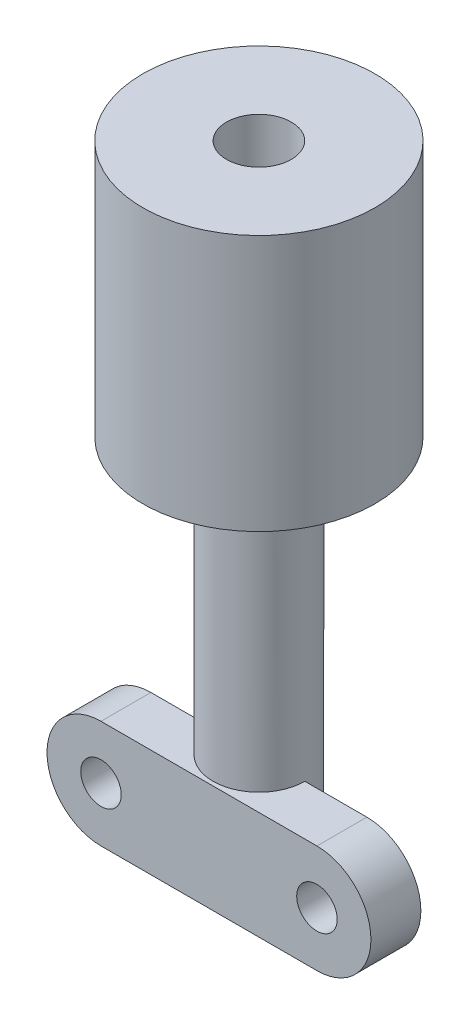
ISO-10303-21;
HEADER;
FILE_DESCRIPTION(('STEP AP214'),'2;1');
FILE_NAME('part.step','',(''),(''),'','','');
FILE_SCHEMA(('AUTOMOTIVE_DESIGN { 1 0 10303 214 1 1 1 1 }'));
ENDSEC;
DATA;
#1=APPLICATION_CONTEXT('core data for automotive mechanical design processes');
#2=APPLICATION_PROTOCOL_DEFINITION('international standard','automotive_design',2000,#1);
#3=PRODUCT_CONTEXT('',#1,'mechanical');
#4=PRODUCT('Part','Part','',(#3));
#5=PRODUCT_RELATED_PRODUCT_CATEGORY('part','',(#4));
#6=PRODUCT_DEFINITION_FORMATION('','',#4);
#7=PRODUCT_DEFINITION_CONTEXT('part definition',#1,'design');
#8=PRODUCT_DEFINITION('design','',#6,#7);
#9=PRODUCT_DEFINITION_SHAPE('','',#8);
#10=(LENGTH_UNIT() NAMED_UNIT(*) SI_UNIT(.MILLI.,.METRE.));
#11=(NAMED_UNIT(*) PLANE_ANGLE_UNIT() SI_UNIT($,.RADIAN.));
#12=(NAMED_UNIT(*) SI_UNIT($,.STERADIAN.) SOLID_ANGLE_UNIT());
#13=UNCERTAINTY_MEASURE_WITH_UNIT(LENGTH_MEASURE(1.E-05),#10,'distance_accuracy_value','');
#14=(GEOMETRIC_REPRESENTATION_CONTEXT(3) GLOBAL_UNCERTAINTY_ASSIGNED_CONTEXT((#13)) GLOBAL_UNIT_ASSIGNED_CONTEXT((#10,
#11,#12)) REPRESENTATION_CONTEXT('',''));
#15=CARTESIAN_POINT('',(0.,0.,0.));
#16=DIRECTION('',(0.,0.,1.));
#17=DIRECTION('',(1.,0.,0.));
#18=AXIS2_PLACEMENT_3D('',#15,#16,#17);
#19=CARTESIAN_POINT('',(-14.2500001788139,-36.5467350929976,6.));
#20=DIRECTION('',(0.,1.,0.));
#21=DIRECTION('',(1.,0.,0.));
#22=AXIS2_PLACEMENT_3D('',#19,#20,#21);
#23=PLANE('',#22);
#24=CARTESIAN_POINT('',(-14.2500001788139,-36.5467350929976,6.));
#25=DIRECTION('',(0.,1.,0.));
#26=DIRECTION('',(1.,0.,0.));
#27=AXIS2_PLACEMENT_3D('',#24,#25,#26);
#28=CIRCLE('',#27,4.4);
#29=CARTESIAN_POINT('',(-18.6500001788139,-36.5467350929976,6.));
#30=VERTEX_POINT('',#29);
#31=EDGE_CURVE('E150',#30,#30,#28,.T.);
#32=ORIENTED_EDGE('',*,*,#31,.T.);
#33=EDGE_LOOP('',(#32));
#34=FACE_BOUND('',#33,.T.);
#35=CARTESIAN_POINT('',(-14.2500001788139,-36.5467350929976,6.));
#36=DIRECTION('',(0.,1.,0.));
#37=DIRECTION('',(1.,0.,0.));
#38=AXIS2_PLACEMENT_3D('',#35,#36,#37);
#39=CIRCLE('',#38,8.6);
#40=CARTESIAN_POINT('',(-22.8500001788139,-36.5467350929976,6.));
#41=VERTEX_POINT('',#40);
#42=EDGE_CURVE('E10',#41,#41,#39,.T.);
#43=ORIENTED_EDGE('',*,*,#42,.F.);
#44=EDGE_LOOP('',(#43));
#45=FACE_BOUND('',#44,.T.);
#46=ADVANCED_FACE('F15',(#34,#45),#23,.F.);
#47=CARTESIAN_POINT('',(-14.2500001788139,-17.5467350929975,6.));
#48=DIRECTION('',(0.,1.,0.));
#49=DIRECTION('',(1.,0.,0.));
#50=AXIS2_PLACEMENT_3D('',#47,#48,#49);
#51=PLANE('',#50);
#52=CARTESIAN_POINT('',(-14.2500001788139,-17.5467350929975,6.));
#53=DIRECTION('',(0.,-1.,0.));
#54=DIRECTION('',(1.,0.,0.));
#55=AXIS2_PLACEMENT_3D('',#52,#53,#54);
#56=CIRCLE('',#55,2.4);
#57=CARTESIAN_POINT('',(-16.6500001788139,-17.5467350929975,6.));
#58=VERTEX_POINT('',#57);
#59=EDGE_CURVE('E108',#58,#58,#56,.T.);
#60=ORIENTED_EDGE('',*,*,#59,.T.);
#61=EDGE_LOOP('',(#60));
#62=FACE_BOUND('',#61,.T.);
#63=CARTESIAN_POINT('',(-14.2500001788139,-17.5467350929975,6.));
#64=DIRECTION('',(0.,1.,0.));
#65=DIRECTION('',(1.,0.,0.));
#66=AXIS2_PLACEMENT_3D('',#63,#64,#65);
#67=CIRCLE('',#66,8.6);
#68=CARTESIAN_POINT('',(-22.8500001788139,-17.5467350929975,6.));
#69=VERTEX_POINT('',#68);
#70=EDGE_CURVE('E153',#69,#69,#67,.T.);
#71=ORIENTED_EDGE('',*,*,#70,.T.);
#72=EDGE_LOOP('',(#71));
#73=FACE_BOUND('',#72,.T.);
#74=ADVANCED_FACE('F109',(#62,#73),#51,.T.);
#75=CARTESIAN_POINT('',(-14.2500001788139,-36.5467350929976,6.));
#76=DIRECTION('',(0.,1.,0.));
#77=DIRECTION('',(1.,0.,0.));
#78=AXIS2_PLACEMENT_3D('',#75,#76,#77);
#79=CYLINDRICAL_SURFACE('',#78,8.6);
#80=ORIENTED_EDGE('',*,*,#70,.F.);
#81=DIRECTION('',(0.,-1.,0.));
#82=VECTOR('',#81,1.);
#83=CARTESIAN_POINT('',(-22.8500001788139,-36.5467350929976,6.));
#84=LINE('',#83,#82);
#85=EDGE_CURVE('E25',#69,#41,#84,.T.);
#86=ORIENTED_EDGE('',*,*,#85,.T.);
#87=ORIENTED_EDGE('',*,*,#42,.T.);
#88=ORIENTED_EDGE('',*,*,#85,.F.);
#89=EDGE_LOOP('',(#80,#86,#87,#88));
#90=FACE_BOUND('',#89,.T.);
#91=ADVANCED_FACE('F384',(#90),#79,.T.);
#92=CARTESIAN_POINT('',(-14.2500001788139,-37.7467350929976,6.));
#93=DIRECTION('',(0.,1.,0.));
#94=DIRECTION('',(1.,0.,0.));
#95=AXIS2_PLACEMENT_3D('',#92,#93,#94);
#96=CONICAL_SURFACE('',#95,3.9,0.394791119699761);
#97=CARTESIAN_POINT('',(-14.2500001788139,-38.9467350929976,6.));
#98=DIRECTION('',(0.,-1.,0.));
#99=DIRECTION('',(1.,0.,0.));
#100=AXIS2_PLACEMENT_3D('',#97,#98,#99);
#101=CIRCLE('',#100,3.4);
#102=CARTESIAN_POINT('',(-17.6500001788139,-38.9467350929976,6.));
#103=VERTEX_POINT('',#102);
#104=EDGE_CURVE('E123',#103,#103,#101,.T.);
#105=ORIENTED_EDGE('',*,*,#104,.F.);
#106=DIRECTION('',(-0.384615384615385,0.923076923076923,0.));
#107=VECTOR('',#106,1.);
#108=CARTESIAN_POINT('',(-18.1500001788139,-37.7467350929976,6.));
#109=LINE('',#108,#107);
#110=EDGE_CURVE('E154',#103,#30,#109,.T.);
#111=ORIENTED_EDGE('',*,*,#110,.T.);
#112=ORIENTED_EDGE('',*,*,#31,.F.);
#113=ORIENTED_EDGE('',*,*,#110,.F.);
#114=EDGE_LOOP('',(#105,#111,#112,#113));
#115=FACE_BOUND('',#114,.T.);
#116=ADVANCED_FACE('F388',(#115),#96,.T.);
#117=CARTESIAN_POINT('',(-14.2500001788139,-38.9467350929976,6.));
#118=DIRECTION('',(0.,-1.,0.));
#119=DIRECTION('',(1.,0.,0.));
#120=AXIS2_PLACEMENT_3D('',#117,#118,#119);
#121=CYLINDRICAL_SURFACE('',#120,3.4);
#122=CARTESIAN_POINT('',(-14.2500001788139,-56.9467350929975,6.));
#123=DIRECTION('',(0.,1.,0.));
#124=DIRECTION('',(1.,0.,0.));
#125=AXIS2_PLACEMENT_3D('',#122,#123,#124);
#126=CIRCLE('',#125,3.4);
#127=CARTESIAN_POINT('',(-17.6500001788139,-56.9467350929975,6.));
#128=VERTEX_POINT('',#127);
#129=CARTESIAN_POINT('',(-10.8500001788139,-56.9467350929975,6.));
#130=VERTEX_POINT('',#129);
#131=EDGE_CURVE('E180',#128,#130,#126,.T.);
#132=ORIENTED_EDGE('',*,*,#131,.T.);
#133=DIRECTION('',(0.,1.,0.));
#134=VECTOR('',#133,1.);
#135=CARTESIAN_POINT('',(-10.8500001788139,-56.9467350929975,6.));
#136=LINE('',#135,#134);
#137=CARTESIAN_POINT('',(-10.8500001788139,-64.9467350929976,6.));
#138=VERTEX_POINT('',#137);
#139=EDGE_CURVE('E172',#138,#130,#136,.T.);
#140=ORIENTED_EDGE('',*,*,#139,.F.);
#141=CARTESIAN_POINT('',(-14.2500001788139,-64.9467350929976,6.));
#142=DIRECTION('',(0.,-1.,0.));
#143=DIRECTION('',(1.,0.,0.));
#144=AXIS2_PLACEMENT_3D('',#141,#142,#143);
#145=CIRCLE('',#144,3.4);
#146=CARTESIAN_POINT('',(-17.6500001788139,-64.9467350929976,6.));
#147=VERTEX_POINT('',#146);
#148=EDGE_CURVE('E188',#147,#138,#145,.T.);
#149=ORIENTED_EDGE('',*,*,#148,.F.);
#150=DIRECTION('',(0.,-1.,0.));
#151=VECTOR('',#150,1.);
#152=CARTESIAN_POINT('',(-17.6500001788139,-56.9467350929975,6.));
#153=LINE('',#152,#151);
#154=EDGE_CURVE('E125',#128,#147,#153,.T.);
#155=ORIENTED_EDGE('',*,*,#154,.F.);
#156=DIRECTION('',(0.,1.,0.));
#157=VECTOR('',#156,1.);
#158=CARTESIAN_POINT('',(-17.6500001788139,-38.9467350929976,6.));
#159=LINE('',#158,#157);
#160=EDGE_CURVE('E114',#128,#103,#159,.T.);
#161=ORIENTED_EDGE('',*,*,#160,.T.);
#162=ORIENTED_EDGE('',*,*,#104,.T.);
#163=ORIENTED_EDGE('',*,*,#160,.F.);
#164=EDGE_LOOP('',(#132,#140,#149,#155,#161,#162,#163));
#165=FACE_BOUND('',#164,.T.);
#166=ADVANCED_FACE('F403',(#165),#121,.T.);
#167=CARTESIAN_POINT('',(-14.2500001788139,-64.9467350929976,6.));
#168=DIRECTION('',(0.,1.,0.));
#169=DIRECTION('',(1.,0.,0.));
#170=AXIS2_PLACEMENT_3D('',#167,#168,#169);
#171=CYLINDRICAL_SURFACE('',#170,2.4);
#172=CARTESIAN_POINT('',(-14.2500001788139,-64.9467350929976,6.));
#173=DIRECTION('',(0.,1.,0.));
#174=DIRECTION('',(1.,0.,0.));
#175=AXIS2_PLACEMENT_3D('',#172,#173,#174);
#176=CIRCLE('',#175,2.4);
#177=CARTESIAN_POINT('',(-16.6500001788139,-64.9467350929976,6.));
#178=VERTEX_POINT('',#177);
#179=EDGE_CURVE('E214',#178,#178,#176,.T.);
#180=ORIENTED_EDGE('',*,*,#179,.F.);
#181=DIRECTION('',(0.,1.,0.));
#182=VECTOR('',#181,1.);
#183=CARTESIAN_POINT('',(-16.6500001788139,-64.9467350929976,6.));
#184=LINE('',#183,#182);
#185=EDGE_CURVE('E115',#178,#58,#184,.T.);
#186=ORIENTED_EDGE('',*,*,#185,.T.);
#187=ORIENTED_EDGE('',*,*,#59,.F.);
#188=ORIENTED_EDGE('',*,*,#185,.F.);
#189=EDGE_LOOP('',(#180,#186,#187,#188));
#190=FACE_BOUND('',#189,.T.);
#191=ADVANCED_FACE('F409',(#190),#171,.F.);
#192=CARTESIAN_POINT('',(-14.2500001788139,-60.9467350929976,6.));
#193=DIRECTION('',(0.,0.,1.));
#194=DIRECTION('',(1.,0.,0.));
#195=AXIS2_PLACEMENT_3D('',#192,#193,#194);
#196=PLANE('',#195);
#197=CARTESIAN_POINT('',(-22.2500002980232,-60.9112251549959,6.));
#198=DIRECTION('',(0.,0.,1.));
#199=DIRECTION('',(1.,0.,0.));
#200=AXIS2_PLACEMENT_3D('',#197,#198,#199);
#201=CIRCLE('',#200,1.5);
#202=CARTESIAN_POINT('',(-23.7500002980232,-60.9112251549959,6.));
#203=VERTEX_POINT('',#202);
#204=EDGE_CURVE('E18',#203,#203,#201,.T.);
#205=ORIENTED_EDGE('',*,*,#204,.T.);
#206=EDGE_LOOP('',(#205));
#207=FACE_BOUND('',#206,.T.);
#208=ORIENTED_EDGE('',*,*,#154,.T.);
#209=DIRECTION('',(1.,0.,0.));
#210=VECTOR('',#209,1.);
#211=CARTESIAN_POINT('',(-22.2500001788139,-64.9467350929976,6.));
#212=LINE('',#211,#210);
#213=CARTESIAN_POINT('',(-22.2500001788139,-64.9467350929976,6.));
#214=VERTEX_POINT('',#213);
#215=EDGE_CURVE('E165',#214,#147,#212,.T.);
#216=ORIENTED_EDGE('',*,*,#215,.F.);
#217=CARTESIAN_POINT('',(-22.2500001788139,-60.9467350929976,6.));
#218=DIRECTION('',(0.,0.,1.));
#219=DIRECTION('',(1.,0.,0.));
#220=AXIS2_PLACEMENT_3D('',#217,#218,#219);
#221=CIRCLE('',#220,4.);
#222=CARTESIAN_POINT('',(-22.2500001788139,-56.9467350929975,6.));
#223=VERTEX_POINT('',#222);
#224=EDGE_CURVE('E175',#223,#214,#221,.T.);
#225=ORIENTED_EDGE('',*,*,#224,.F.);
#226=DIRECTION('',(1.,0.,0.));
#227=VECTOR('',#226,1.);
#228=CARTESIAN_POINT('',(-14.2500001788139,-56.9467350929975,6.));
#229=LINE('',#228,#227);
#230=EDGE_CURVE('E198',#223,#128,#229,.T.);
#231=ORIENTED_EDGE('',*,*,#230,.T.);
#232=EDGE_LOOP('',(#208,#216,#225,#231));
#233=FACE_BOUND('',#232,.T.);
#234=ADVANCED_FACE('F275',(#207,#233),#196,.F.);
#235=CARTESIAN_POINT('',(-22.2500001788139,-60.9467350929976,6.));
#236=DIRECTION('',(0.,0.,1.));
#237=DIRECTION('',(-1.,0.,0.));
#238=AXIS2_PLACEMENT_3D('',#235,#236,#237);
#239=CYLINDRICAL_SURFACE('',#238,4.);
#240=CARTESIAN_POINT('',(-22.2500001788139,-60.9467350929976,9.7));
#241=DIRECTION('',(0.,0.,-1.));
#242=DIRECTION('',(1.,0.,0.));
#243=AXIS2_PLACEMENT_3D('',#240,#241,#242);
#244=CIRCLE('',#243,4.);
#245=CARTESIAN_POINT('',(-22.2500001788139,-64.9467350929976,9.7));
#246=VERTEX_POINT('',#245);
#247=CARTESIAN_POINT('',(-22.2500001788139,-56.9467350929975,9.7));
#248=VERTEX_POINT('',#247);
#249=EDGE_CURVE('E143',#246,#248,#244,.T.);
#250=ORIENTED_EDGE('',*,*,#249,.T.);
#251=DIRECTION('',(0.,0.,1.));
#252=VECTOR('',#251,1.);
#253=CARTESIAN_POINT('',(-22.2500001788139,-56.9467350929975,6.));
#254=LINE('',#253,#252);
#255=EDGE_CURVE('E168',#223,#248,#254,.T.);
#256=ORIENTED_EDGE('',*,*,#255,.F.);
#257=ORIENTED_EDGE('',*,*,#224,.T.);
#258=DIRECTION('',(0.,0.,1.));
#259=VECTOR('',#258,1.);
#260=CARTESIAN_POINT('',(-22.2500001788139,-64.9467350929976,6.));
#261=LINE('',#260,#259);
#262=EDGE_CURVE('E132',#214,#246,#261,.T.);
#263=ORIENTED_EDGE('',*,*,#262,.T.);
#264=EDGE_LOOP('',(#250,#256,#257,#263));
#265=FACE_BOUND('',#264,.T.);
#266=ADVANCED_FACE('F466',(#265),#239,.T.);
#267=CARTESIAN_POINT('',(-22.2500002980232,-60.9112251549959,6.));
#268=DIRECTION('',(0.,0.,1.));
#269=DIRECTION('',(1.,0.,0.));
#270=AXIS2_PLACEMENT_3D('',#267,#268,#269);
#271=CYLINDRICAL_SURFACE('',#270,1.5);
#272=ORIENTED_EDGE('',*,*,#204,.F.);
#273=DIRECTION('',(0.,0.,1.));
#274=VECTOR('',#273,1.);
#275=CARTESIAN_POINT('',(-23.7500002980232,-60.9112251549959,6.));
#276=LINE('',#275,#274);
#277=CARTESIAN_POINT('',(-23.7500002980232,-60.9112251549959,9.7));
#278=VERTEX_POINT('',#277);
#279=EDGE_CURVE('E181',#203,#278,#276,.T.);
#280=ORIENTED_EDGE('',*,*,#279,.T.);
#281=CARTESIAN_POINT('',(-22.2500002980232,-60.9112251549959,9.7));
#282=DIRECTION('',(0.,0.,1.));
#283=DIRECTION('',(1.,0.,0.));
#284=AXIS2_PLACEMENT_3D('',#281,#282,#283);
#285=CIRCLE('',#284,1.5);
#286=EDGE_CURVE('E157',#278,#278,#285,.T.);
#287=ORIENTED_EDGE('',*,*,#286,.T.);
#288=ORIENTED_EDGE('',*,*,#279,.F.);
#289=EDGE_LOOP('',(#272,#280,#287,#288));
#290=FACE_BOUND('',#289,.T.);
#291=ADVANCED_FACE('F271',(#290),#271,.F.);
#292=CARTESIAN_POINT('',(-6.25000005960464,-60.9112251549959,6.));
#293=DIRECTION('',(0.,0.,1.));
#294=DIRECTION('',(1.,0.,0.));
#295=AXIS2_PLACEMENT_3D('',#292,#293,#294);
#296=CYLINDRICAL_SURFACE('',#295,1.5);
#297=CARTESIAN_POINT('',(-6.25000005960464,-60.9112251549959,6.));
#298=DIRECTION('',(0.,0.,1.));
#299=DIRECTION('',(1.,0.,0.));
#300=AXIS2_PLACEMENT_3D('',#297,#298,#299);
#301=CIRCLE('',#300,1.5);
#302=CARTESIAN_POINT('',(-7.75000005960464,-60.9112251549959,6.));
#303=VERTEX_POINT('',#302);
#304=EDGE_CURVE('E138',#303,#303,#301,.T.);
#305=ORIENTED_EDGE('',*,*,#304,.F.);
#306=DIRECTION('',(0.,0.,1.));
#307=VECTOR('',#306,1.);
#308=CARTESIAN_POINT('',(-7.75000005960464,-60.9112251549959,6.));
#309=LINE('',#308,#307);
#310=CARTESIAN_POINT('',(-7.75000005960464,-60.9112251549959,9.7));
#311=VERTEX_POINT('',#310);
#312=EDGE_CURVE('E134',#303,#311,#309,.T.);
#313=ORIENTED_EDGE('',*,*,#312,.T.);
#314=CARTESIAN_POINT('',(-6.25000005960464,-60.9112251549959,9.7));
#315=DIRECTION('',(0.,0.,1.));
#316=DIRECTION('',(1.,0.,0.));
#317=AXIS2_PLACEMENT_3D('',#314,#315,#316);
#318=CIRCLE('',#317,1.5);
#319=EDGE_CURVE('E149',#311,#311,#318,.T.);
#320=ORIENTED_EDGE('',*,*,#319,.T.);
#321=ORIENTED_EDGE('',*,*,#312,.F.);
#322=EDGE_LOOP('',(#305,#313,#320,#321));
#323=FACE_BOUND('',#322,.T.);
#324=ADVANCED_FACE('F417',(#323),#296,.F.);
#325=CARTESIAN_POINT('',(-14.2500001788139,-60.9467350929976,6.));
#326=DIRECTION('',(0.,0.,1.));
#327=DIRECTION('',(1.,0.,0.));
#328=AXIS2_PLACEMENT_3D('',#325,#326,#327);
#329=PLANE('',#328);
#330=ORIENTED_EDGE('',*,*,#304,.T.);
#331=EDGE_LOOP('',(#330));
#332=FACE_BOUND('',#331,.T.);
#333=ORIENTED_EDGE('',*,*,#139,.T.);
#334=DIRECTION('',(1.,0.,0.));
#335=VECTOR('',#334,1.);
#336=CARTESIAN_POINT('',(-14.2500001788139,-56.9467350929975,6.));
#337=LINE('',#336,#335);
#338=CARTESIAN_POINT('',(-6.25000017881393,-56.9467350929975,6.));
#339=VERTEX_POINT('',#338);
#340=EDGE_CURVE('E176',#130,#339,#337,.T.);
#341=ORIENTED_EDGE('',*,*,#340,.T.);
#342=CARTESIAN_POINT('',(-6.25000017881393,-60.9467350929976,6.));
#343=DIRECTION('',(0.,0.,1.));
#344=DIRECTION('',(1.,0.,0.));
#345=AXIS2_PLACEMENT_3D('',#342,#343,#344);
#346=CIRCLE('',#345,4.);
#347=CARTESIAN_POINT('',(-6.25000017881393,-64.9467350929976,6.));
#348=VERTEX_POINT('',#347);
#349=EDGE_CURVE('E129',#348,#339,#346,.T.);
#350=ORIENTED_EDGE('',*,*,#349,.F.);
#351=DIRECTION('',(1.,0.,0.));
#352=VECTOR('',#351,1.);
#353=CARTESIAN_POINT('',(-22.2500001788139,-64.9467350929976,6.));
#354=LINE('',#353,#352);
#355=EDGE_CURVE('E192',#138,#348,#354,.T.);
#356=ORIENTED_EDGE('',*,*,#355,.F.);
#357=EDGE_LOOP('',(#333,#341,#350,#356));
#358=FACE_BOUND('',#357,.T.);
#359=ADVANCED_FACE('F250',(#332,#358),#329,.F.);
#360=CARTESIAN_POINT('',(-22.2500001788139,-64.9467350929976,6.));
#361=DIRECTION('',(0.,-1.,0.));
#362=DIRECTION('',(0.,0.,-1.));
#363=AXIS2_PLACEMENT_3D('',#360,#361,#362);
#364=PLANE('',#363);
#365=ORIENTED_EDGE('',*,*,#179,.T.);
#366=EDGE_LOOP('',(#365));
#367=FACE_BOUND('',#366,.T.);
#368=DIRECTION('',(-1.,0.,0.));
#369=VECTOR('',#368,1.);
#370=CARTESIAN_POINT('',(-18.2500001788139,-64.9467350929976,9.7));
#371=LINE('',#370,#369);
#372=CARTESIAN_POINT('',(-6.25000017881393,-64.9467350929976,9.7));
#373=VERTEX_POINT('',#372);
#374=EDGE_CURVE('E145',#373,#246,#371,.T.);
#375=ORIENTED_EDGE('',*,*,#374,.T.);
#376=ORIENTED_EDGE('',*,*,#262,.F.);
#377=ORIENTED_EDGE('',*,*,#215,.T.);
#378=ORIENTED_EDGE('',*,*,#148,.T.);
#379=ORIENTED_EDGE('',*,*,#355,.T.);
#380=DIRECTION('',(0.,0.,1.));
#381=VECTOR('',#380,1.);
#382=CARTESIAN_POINT('',(-6.25000017881393,-64.9467350929976,6.));
#383=LINE('',#382,#381);
#384=EDGE_CURVE('E133',#348,#373,#383,.T.);
#385=ORIENTED_EDGE('',*,*,#384,.T.);
#386=EDGE_LOOP('',(#375,#376,#377,#378,#379,#385));
#387=FACE_BOUND('',#386,.T.);
#388=ADVANCED_FACE('F244',(#367,#387),#364,.T.);
#389=CARTESIAN_POINT('',(-6.25000017881393,-60.9467350929976,6.));
#390=DIRECTION('',(0.,0.,1.));
#391=DIRECTION('',(1.,0.,0.));
#392=AXIS2_PLACEMENT_3D('',#389,#390,#391);
#393=CYLINDRICAL_SURFACE('',#392,4.);
#394=CARTESIAN_POINT('',(-6.25000017881393,-60.9467350929976,9.7));
#395=DIRECTION('',(0.,0.,-1.));
#396=DIRECTION('',(1.,0.,0.));
#397=AXIS2_PLACEMENT_3D('',#394,#395,#396);
#398=CIRCLE('',#397,4.);
#399=CARTESIAN_POINT('',(-6.25000017881393,-56.9467350929975,9.7));
#400=VERTEX_POINT('',#399);
#401=EDGE_CURVE('E144',#400,#373,#398,.T.);
#402=ORIENTED_EDGE('',*,*,#401,.T.);
#403=ORIENTED_EDGE('',*,*,#384,.F.);
#404=ORIENTED_EDGE('',*,*,#349,.T.);
#405=DIRECTION('',(0.,0.,1.));
#406=VECTOR('',#405,1.);
#407=CARTESIAN_POINT('',(-6.25000017881393,-56.9467350929975,6.));
#408=LINE('',#407,#406);
#409=EDGE_CURVE('E162',#339,#400,#408,.T.);
#410=ORIENTED_EDGE('',*,*,#409,.T.);
#411=EDGE_LOOP('',(#402,#403,#404,#410));
#412=FACE_BOUND('',#411,.T.);
#413=ADVANCED_FACE('F253',(#412),#393,.T.);
#414=CARTESIAN_POINT('',(-6.25000017881393,-56.9467350929975,6.));
#415=DIRECTION('',(0.,1.,0.));
#416=DIRECTION('',(1.,0.,0.));
#417=AXIS2_PLACEMENT_3D('',#414,#415,#416);
#418=PLANE('',#417);
#419=DIRECTION('',(1.,0.,0.));
#420=VECTOR('',#419,1.);
#421=CARTESIAN_POINT('',(-10.2500001788139,-56.9467350929975,9.7));
#422=LINE('',#421,#420);
#423=EDGE_CURVE('E139',#248,#400,#422,.T.);
#424=ORIENTED_EDGE('',*,*,#423,.T.);
#425=ORIENTED_EDGE('',*,*,#409,.F.);
#426=ORIENTED_EDGE('',*,*,#340,.F.);
#427=ORIENTED_EDGE('',*,*,#131,.F.);
#428=ORIENTED_EDGE('',*,*,#230,.F.);
#429=ORIENTED_EDGE('',*,*,#255,.T.);
#430=EDGE_LOOP('',(#424,#425,#426,#427,#428,#429));
#431=FACE_BOUND('',#430,.T.);
#432=ADVANCED_FACE('F395',(#431),#418,.T.);
#433=CARTESIAN_POINT('',(-14.2500001788139,-60.9467350929976,9.7));
#434=DIRECTION('',(0.,0.,1.));
#435=DIRECTION('',(1.,0.,0.));
#436=AXIS2_PLACEMENT_3D('',#433,#434,#435);
#437=PLANE('',#436);
#438=ORIENTED_EDGE('',*,*,#286,.F.);
#439=EDGE_LOOP('',(#438));
#440=FACE_BOUND('',#439,.T.);
#441=ORIENTED_EDGE('',*,*,#319,.F.);
#442=EDGE_LOOP('',(#441));
#443=FACE_BOUND('',#442,.T.);
#444=ORIENTED_EDGE('',*,*,#401,.F.);
#445=ORIENTED_EDGE('',*,*,#423,.F.);
#446=ORIENTED_EDGE('',*,*,#249,.F.);
#447=ORIENTED_EDGE('',*,*,#374,.F.);
#448=EDGE_LOOP('',(#444,#445,#446,#447));
#449=FACE_BOUND('',#448,.T.);
#450=ADVANCED_FACE('F257',(#440,#443,#449),#437,.T.);
#451=CLOSED_SHELL('',(#46,#74,#91,#116,#166,#191,#234,#266,#291,#324,#359,#388,#413,#432,#450));
#452=MANIFOLD_SOLID_BREP('B1',#451);
#453=ADVANCED_BREP_SHAPE_REPRESENTATION('',(#18,#452),#14);
#454=SHAPE_DEFINITION_REPRESENTATION(#9,#453);
ENDSEC;
END-ISO-10303-21;
